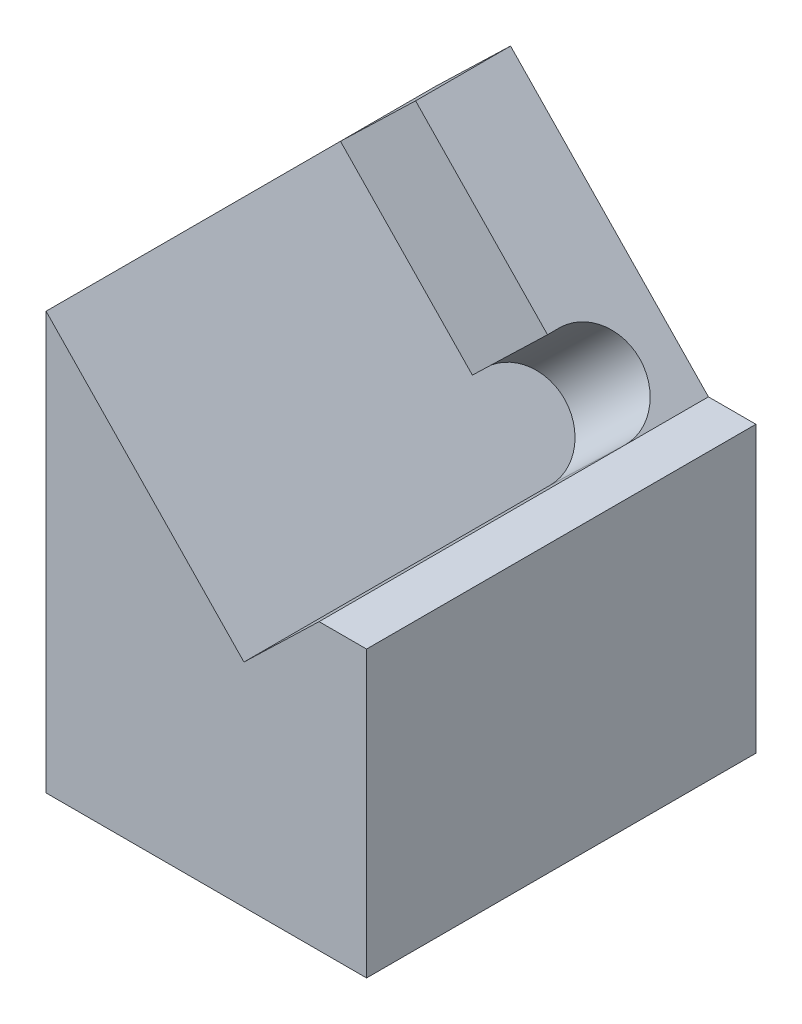
ISO-10303-21;
HEADER;
FILE_DESCRIPTION(('STEP AP214'),'2;1');
FILE_NAME('part.step','',(''),(''),'','','');
FILE_SCHEMA(('AUTOMOTIVE_DESIGN { 1 0 10303 214 1 1 1 1 }'));
ENDSEC;
DATA;
#1=APPLICATION_CONTEXT('core data for automotive mechanical design processes');
#2=APPLICATION_PROTOCOL_DEFINITION('international standard','automotive_design',2000,#1);
#3=PRODUCT_CONTEXT('',#1,'mechanical');
#4=PRODUCT('Part','Part','',(#3));
#5=PRODUCT_RELATED_PRODUCT_CATEGORY('part','',(#4));
#6=PRODUCT_DEFINITION_FORMATION('','',#4);
#7=PRODUCT_DEFINITION_CONTEXT('part definition',#1,'design');
#8=PRODUCT_DEFINITION('design','',#6,#7);
#9=PRODUCT_DEFINITION_SHAPE('','',#8);
#10=(LENGTH_UNIT() NAMED_UNIT(*) SI_UNIT(.MILLI.,.METRE.));
#11=(NAMED_UNIT(*) PLANE_ANGLE_UNIT() SI_UNIT($,.RADIAN.));
#12=(NAMED_UNIT(*) SI_UNIT($,.STERADIAN.) SOLID_ANGLE_UNIT());
#13=UNCERTAINTY_MEASURE_WITH_UNIT(LENGTH_MEASURE(1.E-05),#10,'distance_accuracy_value','');
#14=(GEOMETRIC_REPRESENTATION_CONTEXT(3) GLOBAL_UNCERTAINTY_ASSIGNED_CONTEXT((#13)) GLOBAL_UNIT_ASSIGNED_CONTEXT((#10,
#11,#12)) REPRESENTATION_CONTEXT('',''));
#15=CARTESIAN_POINT('',(0.,0.,0.));
#16=DIRECTION('',(0.,0.,1.));
#17=DIRECTION('',(1.,0.,0.));
#18=AXIS2_PLACEMENT_3D('',#15,#16,#17);
#19=CARTESIAN_POINT('',(6.75,2.,8.2));
#20=DIRECTION('',(-1.,0.,0.));
#21=DIRECTION('',(0.,0.,1.));
#22=AXIS2_PLACEMENT_3D('',#19,#20,#21);
#23=PLANE('',#22);
#24=DIRECTION('',(0.,1.,0.));
#25=VECTOR('',#24,1.);
#26=CARTESIAN_POINT('',(6.75,2.,0.));
#27=LINE('',#26,#25);
#28=CARTESIAN_POINT('',(6.75,-4.,0.));
#29=VERTEX_POINT('',#28);
#30=CARTESIAN_POINT('',(6.75,2.,0.));
#31=VERTEX_POINT('',#30);
#32=EDGE_CURVE('E125',#29,#31,#27,.T.);
#33=ORIENTED_EDGE('',*,*,#32,.T.);
#34=DIRECTION('',(0.,0.,-1.));
#35=VECTOR('',#34,1.);
#36=CARTESIAN_POINT('',(6.75,2.,8.2));
#37=LINE('',#36,#35);
#38=CARTESIAN_POINT('',(6.75,2.,8.2));
#39=VERTEX_POINT('',#38);
#40=EDGE_CURVE('E11',#39,#31,#37,.T.);
#41=ORIENTED_EDGE('',*,*,#40,.F.);
#42=DIRECTION('',(0.,1.,0.));
#43=VECTOR('',#42,1.);
#44=CARTESIAN_POINT('',(6.75,2.,8.2));
#45=LINE('',#44,#43);
#46=CARTESIAN_POINT('',(6.75,-4.,8.2));
#47=VERTEX_POINT('',#46);
#48=EDGE_CURVE('E98',#47,#39,#45,.T.);
#49=ORIENTED_EDGE('',*,*,#48,.F.);
#50=DIRECTION('',(0.,0.,1.));
#51=VECTOR('',#50,1.);
#52=CARTESIAN_POINT('',(6.75,-4.,8.2));
#53=LINE('',#52,#51);
#54=EDGE_CURVE('E169',#29,#47,#53,.T.);
#55=ORIENTED_EDGE('',*,*,#54,.F.);
#56=EDGE_LOOP('',(#33,#41,#49,#55));
#57=FACE_BOUND('',#56,.T.);
#58=ADVANCED_FACE('F36',(#57),#23,.F.);
#59=CARTESIAN_POINT('',(5.75,2.,8.2));
#60=DIRECTION('',(0.,-1.,0.));
#61=DIRECTION('',(0.,0.,-1.));
#62=AXIS2_PLACEMENT_3D('',#59,#60,#61);
#63=PLANE('',#62);
#64=DIRECTION('',(-1.,0.,0.));
#65=VECTOR('',#64,1.);
#66=CARTESIAN_POINT('',(5.75,2.,0.));
#67=LINE('',#66,#65);
#68=CARTESIAN_POINT('',(5.75,2.,0.));
#69=VERTEX_POINT('',#68);
#70=EDGE_CURVE('E121',#31,#69,#67,.T.);
#71=ORIENTED_EDGE('',*,*,#70,.T.);
#72=DIRECTION('',(0.,0.,-1.));
#73=VECTOR('',#72,1.);
#74=CARTESIAN_POINT('',(5.75,2.,8.2));
#75=LINE('',#74,#73);
#76=CARTESIAN_POINT('',(5.75,2.,1.75));
#77=VERTEX_POINT('',#76);
#78=EDGE_CURVE('E104',#77,#69,#75,.T.);
#79=ORIENTED_EDGE('',*,*,#78,.F.);
#80=CARTESIAN_POINT('',(5.75,2.,8.2));
#81=VERTEX_POINT('',#80);
#82=EDGE_CURVE('E44',#81,#77,#75,.T.);
#83=ORIENTED_EDGE('',*,*,#82,.F.);
#84=DIRECTION('',(-1.,0.,0.));
#85=VECTOR('',#84,1.);
#86=CARTESIAN_POINT('',(5.75,2.,8.2));
#87=LINE('',#86,#85);
#88=EDGE_CURVE('E100',#39,#81,#87,.T.);
#89=ORIENTED_EDGE('',*,*,#88,.F.);
#90=ORIENTED_EDGE('',*,*,#40,.T.);
#91=EDGE_LOOP('',(#71,#79,#83,#89,#90));
#92=FACE_BOUND('',#91,.T.);
#93=ADVANCED_FACE('F122',(#92),#63,.F.);
#94=CARTESIAN_POINT('',(1.58254756074504,6.31552333212898,8.2));
#95=DIRECTION('',(-0.719339800338653,-0.694658370458996,0.));
#96=DIRECTION('',(0.694658370458996,-0.719339800338653,0.));
#97=AXIS2_PLACEMENT_3D('',#94,#95,#96);
#98=PLANE('',#97);
#99=DIRECTION('',(0.,0.,-1.));
#100=VECTOR('',#99,1.);
#101=CARTESIAN_POINT('',(1.58254756074504,6.31552333212898,8.2));
#102=LINE('',#101,#100);
#103=CARTESIAN_POINT('',(1.58254756074504,6.31552333212899,2.));
#104=VERTEX_POINT('',#103);
#105=CARTESIAN_POINT('',(1.58254756074504,6.31552333212898,0.));
#106=VERTEX_POINT('',#105);
#107=EDGE_CURVE('E70',#104,#106,#102,.T.);
#108=ORIENTED_EDGE('',*,*,#107,.F.);
#109=DIRECTION('',(-0.694658370458996,0.719339800338652,0.));
#110=VECTOR('',#109,1.);
#111=CARTESIAN_POINT('',(1.58254756074504,6.31552333212899,2.));
#112=LINE('',#111,#110);
#113=CARTESIAN_POINT('',(4.36068325908201,3.43867960067731,2.));
#114=VERTEX_POINT('',#113);
#115=EDGE_CURVE('E147',#114,#104,#112,.T.);
#116=ORIENTED_EDGE('',*,*,#115,.F.);
#117=DIRECTION('',(0.,0.,1.));
#118=VECTOR('',#117,1.);
#119=CARTESIAN_POINT('',(4.36068325908201,3.43867960067731,2.));
#120=LINE('',#119,#118);
#121=CARTESIAN_POINT('',(4.36068325908201,3.43867960067731,1.75));
#122=VERTEX_POINT('',#121);
#123=EDGE_CURVE('E151',#122,#114,#120,.T.);
#124=ORIENTED_EDGE('',*,*,#123,.F.);
#125=CARTESIAN_POINT('',(5.05534162954101,2.71933980033865,1.75));
#126=DIRECTION('',(0.719339800338652,0.694658370458996,0.));
#127=DIRECTION('',(-0.694658370458996,0.719339800338652,0.));
#128=AXIS2_PLACEMENT_3D('',#125,#126,#127);
#129=CIRCLE('',#128,1.);
#130=EDGE_CURVE('E118',#77,#122,#129,.T.);
#131=ORIENTED_EDGE('',*,*,#130,.F.);
#132=ORIENTED_EDGE('',*,*,#78,.T.);
#133=DIRECTION('',(-0.694658370458996,0.719339800338652,0.));
#134=VECTOR('',#133,1.);
#135=CARTESIAN_POINT('',(1.58254756074504,6.31552333212898,0.));
#136=LINE('',#135,#134);
#137=EDGE_CURVE('E91',#69,#106,#136,.T.);
#138=ORIENTED_EDGE('',*,*,#137,.T.);
#139=EDGE_LOOP('',(#108,#116,#124,#131,#132,#138));
#140=FACE_BOUND('',#139,.T.);
#141=ADVANCED_FACE('F115',(#140),#98,.F.);
#142=CARTESIAN_POINT('',(0.,4.78727491711919,8.2));
#143=DIRECTION('',(0.694658370458996,-0.719339800338653,0.));
#144=DIRECTION('',(0.719339800338653,0.694658370458996,0.));
#145=AXIS2_PLACEMENT_3D('',#142,#143,#144);
#146=PLANE('',#145);
#147=DIRECTION('',(0.,0.,-1.));
#148=VECTOR('',#147,1.);
#149=CARTESIAN_POINT('',(0.,4.78727491711919,8.2));
#150=LINE('',#149,#148);
#151=CARTESIAN_POINT('',(0.,4.78727491711919,2.));
#152=VERTEX_POINT('',#151);
#153=CARTESIAN_POINT('',(0.,4.78727491711919,0.));
#154=VERTEX_POINT('',#153);
#155=EDGE_CURVE('E76',#152,#154,#150,.T.);
#156=ORIENTED_EDGE('',*,*,#155,.F.);
#157=DIRECTION('',(0.719339800338652,0.694658370458996,0.));
#158=VECTOR('',#157,1.);
#159=CARTESIAN_POINT('',(0.,4.78727491711919,2.));
#160=LINE('',#159,#158);
#161=EDGE_CURVE('E129',#152,#104,#160,.T.);
#162=ORIENTED_EDGE('',*,*,#161,.T.);
#163=ORIENTED_EDGE('',*,*,#107,.T.);
#164=DIRECTION('',(-0.719339800338653,-0.694658370458996,0.));
#165=VECTOR('',#164,1.);
#166=CARTESIAN_POINT('',(0.,4.78727491711919,0.));
#167=LINE('',#166,#165);
#168=EDGE_CURVE('E87',#106,#154,#167,.T.);
#169=ORIENTED_EDGE('',*,*,#168,.T.);
#170=EDGE_LOOP('',(#156,#162,#163,#169));
#171=FACE_BOUND('',#170,.T.);
#172=ADVANCED_FACE('F88',(#171),#146,.F.);
#173=CARTESIAN_POINT('',(0.,0.,8.2));
#174=DIRECTION('',(1.,0.,0.));
#175=DIRECTION('',(0.,1.,0.));
#176=AXIS2_PLACEMENT_3D('',#173,#174,#175);
#177=PLANE('',#176);
#178=DIRECTION('',(0.,-1.,0.));
#179=VECTOR('',#178,1.);
#180=CARTESIAN_POINT('',(0.,0.,0.));
#181=LINE('',#180,#179);
#182=CARTESIAN_POINT('',(0.,-4.,0.));
#183=VERTEX_POINT('',#182);
#184=EDGE_CURVE('E81',#154,#183,#181,.T.);
#185=ORIENTED_EDGE('',*,*,#184,.T.);
#186=DIRECTION('',(0.,0.,-1.));
#187=VECTOR('',#186,1.);
#188=CARTESIAN_POINT('',(0.,-4.,8.2));
#189=LINE('',#188,#187);
#190=CARTESIAN_POINT('',(0.,-4.,8.2));
#191=VERTEX_POINT('',#190);
#192=EDGE_CURVE('E173',#191,#183,#189,.T.);
#193=ORIENTED_EDGE('',*,*,#192,.F.);
#194=DIRECTION('',(0.,-1.,0.));
#195=VECTOR('',#194,1.);
#196=CARTESIAN_POINT('',(0.,0.,8.2));
#197=LINE('',#196,#195);
#198=CARTESIAN_POINT('',(0.,4.78727491711919,8.2));
#199=VERTEX_POINT('',#198);
#200=EDGE_CURVE('E84',#199,#191,#197,.T.);
#201=ORIENTED_EDGE('',*,*,#200,.F.);
#202=EDGE_CURVE('E52',#199,#152,#150,.T.);
#203=ORIENTED_EDGE('',*,*,#202,.T.);
#204=ORIENTED_EDGE('',*,*,#155,.T.);
#205=EDGE_LOOP('',(#185,#193,#201,#203,#204));
#206=FACE_BOUND('',#205,.T.);
#207=ADVANCED_FACE('F77',(#206),#177,.F.);
#208=CARTESIAN_POINT('',(0.,0.,8.2));
#209=DIRECTION('',(0.,0.,-1.));
#210=DIRECTION('',(-1.,0.,0.));
#211=AXIS2_PLACEMENT_3D('',#208,#209,#210);
#212=PLANE('',#211);
#213=ORIENTED_EDGE('',*,*,#88,.T.);
#214=DIRECTION('',(0.719339800338652,0.694658370458996,0.));
#215=VECTOR('',#214,1.);
#216=CARTESIAN_POINT('',(4.16745243925497,0.471751584990211,8.2));
#217=LINE('',#216,#215);
#218=CARTESIAN_POINT('',(4.16745243925497,0.471751584990211,8.2));
#219=VERTEX_POINT('',#218);
#220=EDGE_CURVE('E134',#219,#81,#217,.T.);
#221=ORIENTED_EDGE('',*,*,#220,.F.);
#222=DIRECTION('',(0.694658370458996,-0.719339800338652,0.));
#223=VECTOR('',#222,1.);
#224=CARTESIAN_POINT('',(0.,4.78727491711919,8.2));
#225=LINE('',#224,#223);
#226=EDGE_CURVE('E150',#199,#219,#225,.T.);
#227=ORIENTED_EDGE('',*,*,#226,.F.);
#228=ORIENTED_EDGE('',*,*,#200,.T.);
#229=DIRECTION('',(-1.,0.,0.));
#230=VECTOR('',#229,1.);
#231=CARTESIAN_POINT('',(0.,-4.,8.2));
#232=LINE('',#231,#230);
#233=EDGE_CURVE('E155',#47,#191,#232,.T.);
#234=ORIENTED_EDGE('',*,*,#233,.F.);
#235=ORIENTED_EDGE('',*,*,#48,.T.);
#236=EDGE_LOOP('',(#213,#221,#227,#228,#234,#235));
#237=FACE_BOUND('',#236,.T.);
#238=ADVANCED_FACE('F251',(#237),#212,.F.);
#239=CARTESIAN_POINT('',(0.,0.,0.));
#240=DIRECTION('',(0.,0.,-1.));
#241=DIRECTION('',(-1.,0.,0.));
#242=AXIS2_PLACEMENT_3D('',#239,#240,#241);
#243=PLANE('',#242);
#244=ORIENTED_EDGE('',*,*,#32,.F.);
#245=DIRECTION('',(1.,0.,0.));
#246=VECTOR('',#245,1.);
#247=CARTESIAN_POINT('',(0.,-4.,0.));
#248=LINE('',#247,#246);
#249=EDGE_CURVE('E96',#183,#29,#248,.T.);
#250=ORIENTED_EDGE('',*,*,#249,.F.);
#251=ORIENTED_EDGE('',*,*,#184,.F.);
#252=ORIENTED_EDGE('',*,*,#168,.F.);
#253=ORIENTED_EDGE('',*,*,#137,.F.);
#254=ORIENTED_EDGE('',*,*,#70,.F.);
#255=EDGE_LOOP('',(#244,#250,#251,#252,#253,#254));
#256=FACE_BOUND('',#255,.T.);
#257=ADVANCED_FACE('F94',(#256),#243,.T.);
#258=CARTESIAN_POINT('',(0.,4.78727491711919,2.));
#259=DIRECTION('',(0.,0.,-1.));
#260=DIRECTION('',(-1.,0.,0.));
#261=AXIS2_PLACEMENT_3D('',#258,#259,#260);
#262=PLANE('',#261);
#263=ORIENTED_EDGE('',*,*,#115,.T.);
#264=ORIENTED_EDGE('',*,*,#161,.F.);
#265=DIRECTION('',(-0.694658370458996,0.719339800338652,0.));
#266=VECTOR('',#265,1.);
#267=CARTESIAN_POINT('',(0.,4.78727491711919,2.));
#268=LINE('',#267,#266);
#269=CARTESIAN_POINT('',(2.77813569833698,1.91043118566752,2.));
#270=VERTEX_POINT('',#269);
#271=EDGE_CURVE('E137',#270,#152,#268,.T.);
#272=ORIENTED_EDGE('',*,*,#271,.F.);
#273=DIRECTION('',(0.719339800338652,0.694658370458996,0.));
#274=VECTOR('',#273,1.);
#275=CARTESIAN_POINT('',(2.77813569833698,1.91043118566752,2.));
#276=LINE('',#275,#274);
#277=EDGE_CURVE('E143',#270,#114,#276,.T.);
#278=ORIENTED_EDGE('',*,*,#277,.T.);
#279=EDGE_LOOP('',(#263,#264,#272,#278));
#280=FACE_BOUND('',#279,.T.);
#281=ADVANCED_FACE('F241',(#280),#262,.F.);
#282=CARTESIAN_POINT('',(2.77813569833698,1.91043118566752,2.));
#283=DIRECTION('',(-0.694658370458996,0.719339800338652,0.));
#284=DIRECTION('',(-0.719339800338652,-0.694658370458996,0.));
#285=AXIS2_PLACEMENT_3D('',#282,#283,#284);
#286=PLANE('',#285);
#287=ORIENTED_EDGE('',*,*,#123,.T.);
#288=ORIENTED_EDGE('',*,*,#277,.F.);
#289=DIRECTION('',(0.,0.,1.));
#290=VECTOR('',#289,1.);
#291=CARTESIAN_POINT('',(2.77813569833698,1.91043118566752,2.));
#292=LINE('',#291,#290);
#293=CARTESIAN_POINT('',(2.77813569833698,1.91043118566752,1.75));
#294=VERTEX_POINT('',#293);
#295=EDGE_CURVE('E157',#294,#270,#292,.T.);
#296=ORIENTED_EDGE('',*,*,#295,.F.);
#297=DIRECTION('',(0.719339800338652,0.694658370458996,0.));
#298=VECTOR('',#297,1.);
#299=CARTESIAN_POINT('',(2.77813569833698,1.91043118566752,1.75));
#300=LINE('',#299,#298);
#301=EDGE_CURVE('E140',#294,#122,#300,.T.);
#302=ORIENTED_EDGE('',*,*,#301,.T.);
#303=EDGE_LOOP('',(#287,#288,#296,#302));
#304=FACE_BOUND('',#303,.T.);
#305=ADVANCED_FACE('F244',(#304),#286,.F.);
#306=CARTESIAN_POINT('',(3.47279406879597,1.19109138532886,1.75));
#307=DIRECTION('',(0.719339800338652,0.694658370458996,0.));
#308=DIRECTION('',(-0.694658370458996,0.719339800338652,0.));
#309=AXIS2_PLACEMENT_3D('',#306,#307,#308);
#310=CYLINDRICAL_SURFACE('',#309,1.);
#311=ORIENTED_EDGE('',*,*,#130,.T.);
#312=ORIENTED_EDGE('',*,*,#301,.F.);
#313=CARTESIAN_POINT('',(3.47279406879597,1.19109138532886,1.75));
#314=DIRECTION('',(0.719339800338652,0.694658370458996,0.));
#315=DIRECTION('',(-0.694658370458996,0.719339800338652,0.));
#316=AXIS2_PLACEMENT_3D('',#313,#314,#315);
#317=CIRCLE('',#316,1.);
#318=CARTESIAN_POINT('',(4.16745243925497,0.47175158499021,1.75));
#319=VERTEX_POINT('',#318);
#320=EDGE_CURVE('E160',#319,#294,#317,.T.);
#321=ORIENTED_EDGE('',*,*,#320,.F.);
#322=DIRECTION('',(0.719339800338652,0.694658370458996,0.));
#323=VECTOR('',#322,1.);
#324=CARTESIAN_POINT('',(4.16745243925497,0.47175158499021,1.75));
#325=LINE('',#324,#323);
#326=EDGE_CURVE('E136',#319,#77,#325,.T.);
#327=ORIENTED_EDGE('',*,*,#326,.T.);
#328=EDGE_LOOP('',(#311,#312,#321,#327));
#329=FACE_BOUND('',#328,.T.);
#330=ADVANCED_FACE('F248',(#329),#310,.F.);
#331=CARTESIAN_POINT('',(4.16745243925497,0.471751584990211,8.2));
#332=DIRECTION('',(0.694658370458996,-0.719339800338652,0.));
#333=DIRECTION('',(0.719339800338652,0.694658370458996,0.));
#334=AXIS2_PLACEMENT_3D('',#331,#332,#333);
#335=PLANE('',#334);
#336=ORIENTED_EDGE('',*,*,#82,.T.);
#337=ORIENTED_EDGE('',*,*,#326,.F.);
#338=DIRECTION('',(0.,0.,-1.));
#339=VECTOR('',#338,1.);
#340=CARTESIAN_POINT('',(4.16745243925497,0.471751584990211,8.2));
#341=LINE('',#340,#339);
#342=EDGE_CURVE('E163',#219,#319,#341,.T.);
#343=ORIENTED_EDGE('',*,*,#342,.F.);
#344=ORIENTED_EDGE('',*,*,#220,.T.);
#345=EDGE_LOOP('',(#336,#337,#343,#344));
#346=FACE_BOUND('',#345,.T.);
#347=ADVANCED_FACE('F249',(#346),#335,.F.);
#348=CARTESIAN_POINT('',(3.47279406879597,1.19109138532886,1.75));
#349=DIRECTION('',(0.719339800338652,0.694658370458996,0.));
#350=DIRECTION('',(-0.694658370458996,0.719339800338652,0.));
#351=AXIS2_PLACEMENT_3D('',#348,#349,#350);
#352=PLANE('',#351);
#353=ORIENTED_EDGE('',*,*,#226,.T.);
#354=ORIENTED_EDGE('',*,*,#342,.T.);
#355=ORIENTED_EDGE('',*,*,#320,.T.);
#356=ORIENTED_EDGE('',*,*,#295,.T.);
#357=ORIENTED_EDGE('',*,*,#271,.T.);
#358=ORIENTED_EDGE('',*,*,#202,.F.);
#359=EDGE_LOOP('',(#353,#354,#355,#356,#357,#358));
#360=FACE_BOUND('',#359,.T.);
#361=ADVANCED_FACE('F200',(#360),#352,.T.);
#362=CARTESIAN_POINT('',(0.,-4.,0.));
#363=DIRECTION('',(0.,-1.,0.));
#364=DIRECTION('',(0.,0.,-1.));
#365=AXIS2_PLACEMENT_3D('',#362,#363,#364);
#366=PLANE('',#365);
#367=CARTESIAN_POINT('',(2.,-4.,4.1));
#368=DIRECTION('',(0.,-1.,0.));
#369=DIRECTION('',(0.,0.,-1.));
#370=AXIS2_PLACEMENT_3D('',#367,#368,#369);
#371=CIRCLE('',#370,0.79999999999999);
#372=CARTESIAN_POINT('',(2.,-4.,3.30000000000001));
#373=VERTEX_POINT('',#372);
#374=EDGE_CURVE('E190',#373,#373,#371,.T.);
#375=ORIENTED_EDGE('',*,*,#374,.F.);
#376=EDGE_LOOP('',(#375));
#377=FACE_BOUND('',#376,.T.);
#378=CARTESIAN_POINT('',(2.,-4.,7.1));
#379=DIRECTION('',(0.,-1.,0.));
#380=DIRECTION('',(0.,0.,-1.));
#381=AXIS2_PLACEMENT_3D('',#378,#379,#380);
#382=CIRCLE('',#381,0.749999999999989);
#383=CARTESIAN_POINT('',(2.,-4.,6.35000000000001));
#384=VERTEX_POINT('',#383);
#385=EDGE_CURVE('E184',#384,#384,#382,.T.);
#386=ORIENTED_EDGE('',*,*,#385,.F.);
#387=EDGE_LOOP('',(#386));
#388=FACE_BOUND('',#387,.T.);
#389=CARTESIAN_POINT('',(2.,-4.,1.1));
#390=DIRECTION('',(0.,-1.,0.));
#391=DIRECTION('',(0.,0.,-1.));
#392=AXIS2_PLACEMENT_3D('',#389,#390,#391);
#393=CIRCLE('',#392,0.749999999999989);
#394=CARTESIAN_POINT('',(2.,-4.,0.350000000000011));
#395=VERTEX_POINT('',#394);
#396=EDGE_CURVE('E178',#395,#395,#393,.T.);
#397=ORIENTED_EDGE('',*,*,#396,.F.);
#398=EDGE_LOOP('',(#397));
#399=FACE_BOUND('',#398,.T.);
#400=ORIENTED_EDGE('',*,*,#192,.T.);
#401=ORIENTED_EDGE('',*,*,#249,.T.);
#402=ORIENTED_EDGE('',*,*,#54,.T.);
#403=ORIENTED_EDGE('',*,*,#233,.T.);
#404=EDGE_LOOP('',(#400,#401,#402,#403));
#405=FACE_BOUND('',#404,.T.);
#406=ADVANCED_FACE('F196',(#377,#388,#399,#405),#366,.T.);
#407=CARTESIAN_POINT('',(2.,-1.,1.1));
#408=DIRECTION('',(0.,-1.,0.));
#409=DIRECTION('',(0.,0.,-1.));
#410=AXIS2_PLACEMENT_3D('',#407,#408,#409);
#411=CONICAL_SURFACE('',#410,0.749999999999999,1.02974425867665);
#412=CARTESIAN_POINT('',(2.,-0.54935453572933,1.1));
#413=VERTEX_POINT('',#412);
#414=VERTEX_LOOP('',#413);
#415=FACE_BOUND('',#414,.T.);
#416=CARTESIAN_POINT('',(2.,-1.,1.1));
#417=DIRECTION('',(0.,-1.,0.));
#418=DIRECTION('',(0.,0.,-1.));
#419=AXIS2_PLACEMENT_3D('',#416,#417,#418);
#420=CIRCLE('',#419,0.749999999999999);
#421=CARTESIAN_POINT('',(2.,-1.,0.35));
#422=VERTEX_POINT('',#421);
#423=EDGE_CURVE('E175',#422,#422,#420,.T.);
#424=ORIENTED_EDGE('',*,*,#423,.T.);
#425=EDGE_LOOP('',(#424));
#426=FACE_BOUND('',#425,.T.);
#427=ADVANCED_FACE('F199',(#415,#426),#411,.F.);
#428=CARTESIAN_POINT('',(2.,-4.,1.1));
#429=DIRECTION('',(0.,-1.,0.));
#430=DIRECTION('',(0.,0.,-1.));
#431=AXIS2_PLACEMENT_3D('',#428,#429,#430);
#432=CYLINDRICAL_SURFACE('',#431,0.749999999999994);
#433=ORIENTED_EDGE('',*,*,#423,.F.);
#434=EDGE_LOOP('',(#433));
#435=FACE_BOUND('',#434,.T.);
#436=ORIENTED_EDGE('',*,*,#396,.T.);
#437=EDGE_LOOP('',(#436));
#438=FACE_BOUND('',#437,.T.);
#439=ADVANCED_FACE('F302',(#435,#438),#432,.F.);
#440=CARTESIAN_POINT('',(2.,-1.,7.1));
#441=DIRECTION('',(0.,-1.,0.));
#442=DIRECTION('',(0.,0.,-1.));
#443=AXIS2_PLACEMENT_3D('',#440,#441,#442);
#444=CONICAL_SURFACE('',#443,0.749999999999999,1.02974425867665);
#445=CARTESIAN_POINT('',(2.,-0.54935453572933,7.1));
#446=VERTEX_POINT('',#445);
#447=VERTEX_LOOP('',#446);
#448=FACE_BOUND('',#447,.T.);
#449=CARTESIAN_POINT('',(2.,-1.,7.1));
#450=DIRECTION('',(0.,-1.,0.));
#451=DIRECTION('',(0.,0.,-1.));
#452=AXIS2_PLACEMENT_3D('',#449,#450,#451);
#453=CIRCLE('',#452,0.749999999999999);
#454=CARTESIAN_POINT('',(2.,-1.,6.35));
#455=VERTEX_POINT('',#454);
#456=EDGE_CURVE('E181',#455,#455,#453,.T.);
#457=ORIENTED_EDGE('',*,*,#456,.T.);
#458=EDGE_LOOP('',(#457));
#459=FACE_BOUND('',#458,.T.);
#460=ADVANCED_FACE('F306',(#448,#459),#444,.F.);
#461=CARTESIAN_POINT('',(2.,-4.,7.1));
#462=DIRECTION('',(0.,-1.,0.));
#463=DIRECTION('',(0.,0.,-1.));
#464=AXIS2_PLACEMENT_3D('',#461,#462,#463);
#465=CYLINDRICAL_SURFACE('',#464,0.749999999999994);
#466=ORIENTED_EDGE('',*,*,#456,.F.);
#467=EDGE_LOOP('',(#466));
#468=FACE_BOUND('',#467,.T.);
#469=ORIENTED_EDGE('',*,*,#385,.T.);
#470=EDGE_LOOP('',(#469));
#471=FACE_BOUND('',#470,.T.);
#472=ADVANCED_FACE('F265',(#468,#471),#465,.F.);
#473=CARTESIAN_POINT('',(2.,0.,4.1));
#474=DIRECTION('',(0.,-1.,0.));
#475=DIRECTION('',(0.,0.,-1.));
#476=AXIS2_PLACEMENT_3D('',#473,#474,#475);
#477=CONICAL_SURFACE('',#476,0.799999999999999,1.02974425867665);
#478=CARTESIAN_POINT('',(2.,0.480688495222049,4.1));
#479=VERTEX_POINT('',#478);
#480=VERTEX_LOOP('',#479);
#481=FACE_BOUND('',#480,.T.);
#482=CARTESIAN_POINT('',(2.,0.,4.1));
#483=DIRECTION('',(0.,-1.,0.));
#484=DIRECTION('',(0.,0.,-1.));
#485=AXIS2_PLACEMENT_3D('',#482,#483,#484);
#486=CIRCLE('',#485,0.799999999999999);
#487=CARTESIAN_POINT('',(2.,0.,3.3));
#488=VERTEX_POINT('',#487);
#489=EDGE_CURVE('E187',#488,#488,#486,.T.);
#490=ORIENTED_EDGE('',*,*,#489,.T.);
#491=EDGE_LOOP('',(#490));
#492=FACE_BOUND('',#491,.T.);
#493=ADVANCED_FACE('F262',(#481,#492),#477,.F.);
#494=CARTESIAN_POINT('',(2.,-4.,4.1));
#495=DIRECTION('',(0.,-1.,0.));
#496=DIRECTION('',(0.,0.,-1.));
#497=AXIS2_PLACEMENT_3D('',#494,#495,#496);
#498=CYLINDRICAL_SURFACE('',#497,0.799999999999994);
#499=ORIENTED_EDGE('',*,*,#489,.F.);
#500=EDGE_LOOP('',(#499));
#501=FACE_BOUND('',#500,.T.);
#502=ORIENTED_EDGE('',*,*,#374,.T.);
#503=EDGE_LOOP('',(#502));
#504=FACE_BOUND('',#503,.T.);
#505=ADVANCED_FACE('F194',(#501,#504),#498,.F.);
#506=CLOSED_SHELL('',(#58,#93,#141,#172,#207,#238,#257,#281,#305,#330,#347,#361,#406,#427,#439,
#460,#472,#493,#505));
#507=MANIFOLD_SOLID_BREP('B2',#506);
#508=ADVANCED_BREP_SHAPE_REPRESENTATION('',(#18,#507),#14);
#509=SHAPE_DEFINITION_REPRESENTATION(#9,#508);
ENDSEC;
END-ISO-10303-21;
